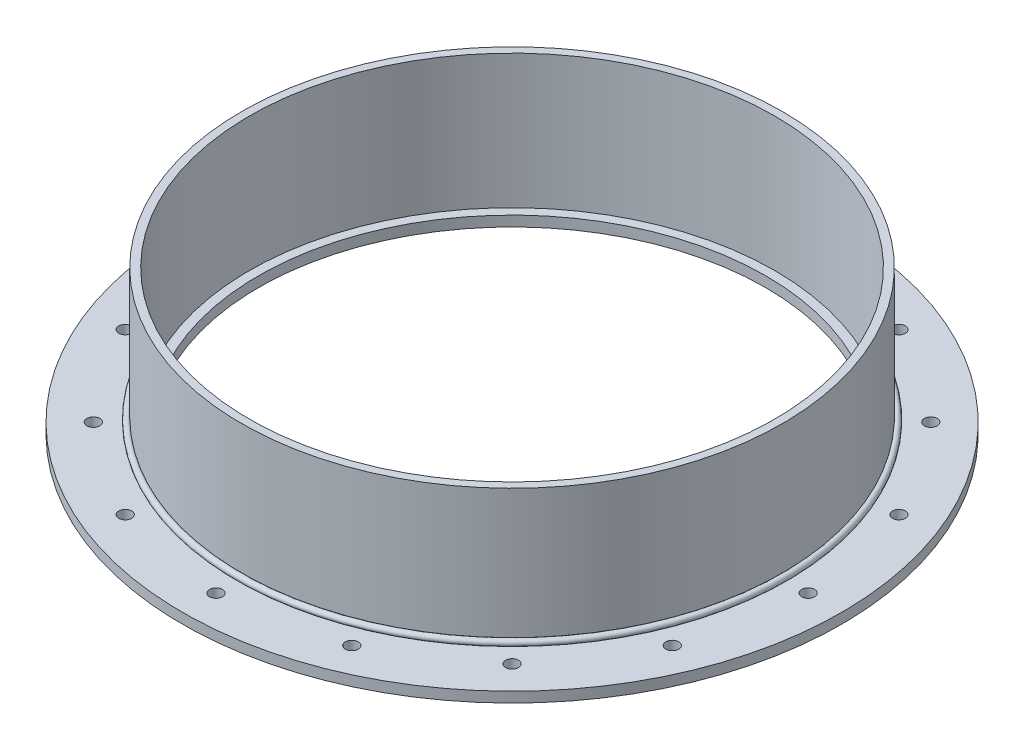
ISO-10303-21;
HEADER;
FILE_DESCRIPTION(('STEP AP214'),'2;1');
FILE_NAME('part.step','',(''),(''),'','','');
FILE_SCHEMA(('AUTOMOTIVE_DESIGN { 1 0 10303 214 1 1 1 1 }'));
ENDSEC;
DATA;
#1=APPLICATION_CONTEXT('core data for automotive mechanical design processes');
#2=APPLICATION_PROTOCOL_DEFINITION('international standard','automotive_design',2000,#1);
#3=PRODUCT_CONTEXT('',#1,'mechanical');
#4=PRODUCT('Part','Part','',(#3));
#5=PRODUCT_RELATED_PRODUCT_CATEGORY('part','',(#4));
#6=PRODUCT_DEFINITION_FORMATION('','',#4);
#7=PRODUCT_DEFINITION_CONTEXT('part definition',#1,'design');
#8=PRODUCT_DEFINITION('design','',#6,#7);
#9=PRODUCT_DEFINITION_SHAPE('','',#8);
#10=(LENGTH_UNIT() NAMED_UNIT(*) SI_UNIT(.MILLI.,.METRE.));
#11=(NAMED_UNIT(*) PLANE_ANGLE_UNIT() SI_UNIT($,.RADIAN.));
#12=(NAMED_UNIT(*) SI_UNIT($,.STERADIAN.) SOLID_ANGLE_UNIT());
#13=UNCERTAINTY_MEASURE_WITH_UNIT(LENGTH_MEASURE(1.E-05),#10,'distance_accuracy_value','');
#14=(GEOMETRIC_REPRESENTATION_CONTEXT(3) GLOBAL_UNCERTAINTY_ASSIGNED_CONTEXT((#13)) GLOBAL_UNIT_ASSIGNED_CONTEXT((#10,
#11,#12)) REPRESENTATION_CONTEXT('',''));
#15=CARTESIAN_POINT('',(0.,0.,0.));
#16=DIRECTION('',(0.,0.,1.));
#17=DIRECTION('',(1.,0.,0.));
#18=AXIS2_PLACEMENT_3D('',#15,#16,#17);
#19=CARTESIAN_POINT('',(0.,7.573372889639,0.));
#20=DIRECTION('',(0.,-1.,0.));
#21=DIRECTION('',(0.,0.,-1.));
#22=AXIS2_PLACEMENT_3D('',#19,#20,#21);
#23=TOROIDAL_SURFACE('',#22,167.910872889639,1.98437500000001);
#24=CARTESIAN_POINT('',(0.,6.35,0.));
#25=DIRECTION('',(0.,-1.,0.));
#26=DIRECTION('',(0.,0.,-1.));
#27=AXIS2_PLACEMENT_3D('',#24,#25,#26);
#28=CIRCLE('',#27,169.473275818951);
#29=CARTESIAN_POINT('',(0.,6.35,-169.473275818951));
#30=VERTEX_POINT('',#29);
#31=EDGE_CURVE('E11',#30,#30,#28,.T.);
#32=ORIENTED_EDGE('',*,*,#31,.F.);
#33=EDGE_LOOP('',(#32));
#34=FACE_BOUND('',#33,.T.);
#35=CARTESIAN_POINT('',(0.,9.13577581895058,0.));
#36=DIRECTION('',(0.,-1.,0.));
#37=DIRECTION('',(0.,0.,-1.));
#38=AXIS2_PLACEMENT_3D('',#35,#36,#37);
#39=CIRCLE('',#38,166.6875);
#40=CARTESIAN_POINT('',(0.,9.13577581895058,-166.6875));
#41=VERTEX_POINT('',#40);
#42=EDGE_CURVE('E61',#41,#41,#39,.T.);
#43=ORIENTED_EDGE('',*,*,#42,.T.);
#44=EDGE_LOOP('',(#43));
#45=FACE_BOUND('',#44,.T.);
#46=ADVANCED_FACE('F48',(#34,#45),#23,.T.);
#47=CARTESIAN_POINT('',(-166.6875,6.35,0.));
#48=DIRECTION('',(0.,1.,0.));
#49=DIRECTION('',(0.,0.,1.));
#50=AXIS2_PLACEMENT_3D('',#47,#48,#49);
#51=PLANE('',#50);
#52=CARTESIAN_POINT('',(0.,6.35,0.));
#53=DIRECTION('',(0.,-1.,0.));
#54=DIRECTION('',(0.,0.,-1.));
#55=AXIS2_PLACEMENT_3D('',#52,#53,#54);
#56=CIRCLE('',#55,166.6875);
#57=CARTESIAN_POINT('',(0.,6.35,-166.6875));
#58=VERTEX_POINT('',#57);
#59=EDGE_CURVE('E55',#58,#58,#56,.T.);
#60=ORIENTED_EDGE('',*,*,#59,.F.);
#61=EDGE_LOOP('',(#60));
#62=FACE_BOUND('',#61,.T.);
#63=ORIENTED_EDGE('',*,*,#31,.T.);
#64=EDGE_LOOP('',(#63));
#65=FACE_BOUND('',#64,.T.);
#66=ADVANCED_FACE('F74',(#62,#65),#51,.F.);
#67=CARTESIAN_POINT('',(0.,0.,0.));
#68=DIRECTION('',(0.,-1.,0.));
#69=DIRECTION('',(0.,0.,-1.));
#70=AXIS2_PLACEMENT_3D('',#67,#68,#69);
#71=CYLINDRICAL_SURFACE('',#70,166.6875);
#72=ORIENTED_EDGE('',*,*,#42,.F.);
#73=EDGE_LOOP('',(#72));
#74=FACE_BOUND('',#73,.T.);
#75=ORIENTED_EDGE('',*,*,#59,.T.);
#76=EDGE_LOOP('',(#75));
#77=FACE_BOUND('',#76,.T.);
#78=ADVANCED_FACE('F72',(#74,#77),#71,.F.);
#79=CLOSED_SHELL('',(#46,#66,#78));
#80=MANIFOLD_SOLID_BREP('B2',#79);
#81=CARTESIAN_POINT('',(0.,0.,0.));
#82=DIRECTION('',(0.,-1.,0.));
#83=DIRECTION('',(0.,0.,-1.));
#84=AXIS2_PLACEMENT_3D('',#81,#82,#83);
#85=CYLINDRICAL_SURFACE('',#84,166.6875);
#86=CARTESIAN_POINT('',(0.,6.35,0.));
#87=DIRECTION('',(0.,-1.,0.));
#88=DIRECTION('',(0.,0.,-1.));
#89=AXIS2_PLACEMENT_3D('',#86,#87,#88);
#90=CIRCLE('',#89,166.6875);
#91=CARTESIAN_POINT('',(0.,6.35,-166.6875));
#92=VERTEX_POINT('',#91);
#93=EDGE_CURVE('E133',#92,#92,#90,.T.);
#94=ORIENTED_EDGE('',*,*,#93,.F.);
#95=EDGE_LOOP('',(#94));
#96=FACE_BOUND('',#95,.T.);
#97=CARTESIAN_POINT('',(0.,88.9,0.));
#98=DIRECTION('',(0.,-1.,0.));
#99=DIRECTION('',(0.,0.,-1.));
#100=AXIS2_PLACEMENT_3D('',#97,#98,#99);
#101=CIRCLE('',#100,166.6875);
#102=CARTESIAN_POINT('',(0.,88.9,-166.6875));
#103=VERTEX_POINT('',#102);
#104=EDGE_CURVE('E47',#103,#103,#101,.T.);
#105=ORIENTED_EDGE('',*,*,#104,.T.);
#106=EDGE_LOOP('',(#105));
#107=FACE_BOUND('',#106,.T.);
#108=ADVANCED_FACE('F114',(#96,#107),#85,.T.);
#109=CARTESIAN_POINT('',(-166.6875,88.9,0.));
#110=DIRECTION('',(0.,-1.,0.));
#111=DIRECTION('',(0.,0.,-1.));
#112=AXIS2_PLACEMENT_3D('',#109,#110,#111);
#113=PLANE('',#112);
#114=ORIENTED_EDGE('',*,*,#104,.F.);
#115=EDGE_LOOP('',(#114));
#116=FACE_BOUND('',#115,.T.);
#117=CARTESIAN_POINT('',(0.,88.9,0.));
#118=DIRECTION('',(0.,-1.,0.));
#119=DIRECTION('',(0.,0.,-1.));
#120=AXIS2_PLACEMENT_3D('',#117,#118,#119);
#121=CIRCLE('',#120,161.925);
#122=CARTESIAN_POINT('',(0.,88.9,-161.925));
#123=VERTEX_POINT('',#122);
#124=EDGE_CURVE('E121',#123,#123,#121,.T.);
#125=ORIENTED_EDGE('',*,*,#124,.T.);
#126=EDGE_LOOP('',(#125));
#127=FACE_BOUND('',#126,.T.);
#128=ADVANCED_FACE('F144',(#116,#127),#113,.F.);
#129=CARTESIAN_POINT('',(0.,0.,0.));
#130=DIRECTION('',(0.,-1.,0.));
#131=DIRECTION('',(0.,0.,-1.));
#132=AXIS2_PLACEMENT_3D('',#129,#130,#131);
#133=CYLINDRICAL_SURFACE('',#132,161.925);
#134=ORIENTED_EDGE('',*,*,#124,.F.);
#135=EDGE_LOOP('',(#134));
#136=FACE_BOUND('',#135,.T.);
#137=CARTESIAN_POINT('',(0.,6.35,0.));
#138=DIRECTION('',(0.,-1.,0.));
#139=DIRECTION('',(0.,0.,-1.));
#140=AXIS2_PLACEMENT_3D('',#137,#138,#139);
#141=CIRCLE('',#140,161.925);
#142=CARTESIAN_POINT('',(0.,6.35,-161.925));
#143=VERTEX_POINT('',#142);
#144=EDGE_CURVE('E127',#143,#143,#141,.T.);
#145=ORIENTED_EDGE('',*,*,#144,.T.);
#146=EDGE_LOOP('',(#145));
#147=FACE_BOUND('',#146,.T.);
#148=ADVANCED_FACE('F148',(#136,#147),#133,.F.);
#149=CARTESIAN_POINT('',(-166.6875,6.35,0.));
#150=DIRECTION('',(0.,1.,0.));
#151=DIRECTION('',(0.,0.,1.));
#152=AXIS2_PLACEMENT_3D('',#149,#150,#151);
#153=PLANE('',#152);
#154=ORIENTED_EDGE('',*,*,#144,.F.);
#155=EDGE_LOOP('',(#154));
#156=FACE_BOUND('',#155,.T.);
#157=ORIENTED_EDGE('',*,*,#93,.T.);
#158=EDGE_LOOP('',(#157));
#159=FACE_BOUND('',#158,.T.);
#160=ADVANCED_FACE('F141',(#156,#159),#153,.F.);
#161=CLOSED_SHELL('',(#108,#128,#148,#160));
#162=MANIFOLD_SOLID_BREP('B6',#161);
#163=CARTESIAN_POINT('',(0.,0.,0.));
#164=DIRECTION('',(0.,-1.,0.));
#165=DIRECTION('',(0.,0.,-1.));
#166=AXIS2_PLACEMENT_3D('',#163,#164,#165);
#167=CYLINDRICAL_SURFACE('',#166,156.36875);
#168=CARTESIAN_POINT('',(0.,6.34999999999999,0.));
#169=DIRECTION('',(0.,-1.,0.));
#170=DIRECTION('',(0.,0.,-1.));
#171=AXIS2_PLACEMENT_3D('',#168,#169,#170);
#172=CIRCLE('',#171,156.36875);
#173=CARTESIAN_POINT('',(0.,6.34999999999999,-156.36875));
#174=VERTEX_POINT('',#173);
#175=EDGE_CURVE('E113',#174,#174,#172,.T.);
#176=ORIENTED_EDGE('',*,*,#175,.F.);
#177=EDGE_LOOP('',(#176));
#178=FACE_BOUND('',#177,.T.);
#179=CARTESIAN_POINT('',(0.,0.,0.));
#180=DIRECTION('',(0.,-1.,0.));
#181=DIRECTION('',(0.,0.,-1.));
#182=AXIS2_PLACEMENT_3D('',#179,#180,#181);
#183=CIRCLE('',#182,156.36875);
#184=CARTESIAN_POINT('',(0.,0.,-156.36875));
#185=VERTEX_POINT('',#184);
#186=EDGE_CURVE('E211',#185,#185,#183,.T.);
#187=ORIENTED_EDGE('',*,*,#186,.T.);
#188=EDGE_LOOP('',(#187));
#189=FACE_BOUND('',#188,.T.);
#190=ADVANCED_FACE('F192',(#178,#189),#167,.F.);
#191=CARTESIAN_POINT('',(-156.36875,6.34999999999999,0.));
#192=DIRECTION('',(0.,-1.,0.));
#193=DIRECTION('',(0.,0.,-1.));
#194=AXIS2_PLACEMENT_3D('',#191,#192,#193);
#195=PLANE('',#194);
#196=CARTESIAN_POINT('',(-69.8636441211494,6.34999999999999,-168.665757154093));
#197=DIRECTION('',(0.,1.,0.));
#198=DIRECTION('',(0.382683432365077,0.,0.923879532511292));
#199=AXIS2_PLACEMENT_3D('',#196,#197,#198);
#200=CIRCLE('',#199,3.96875);
#201=CARTESIAN_POINT('',(-68.3448692489505,6.34999999999999,-164.999110259439));
#202=VERTEX_POINT('',#201);
#203=EDGE_CURVE('E338',#202,#202,#200,.T.);
#204=ORIENTED_EDGE('',*,*,#203,.F.);
#205=EDGE_LOOP('',(#204));
#206=FACE_BOUND('',#205,.T.);
#207=CARTESIAN_POINT('',(-129.091181740367,6.34999999999999,-129.091181740371));
#208=DIRECTION('',(0.,1.,0.));
#209=DIRECTION('',(0.707106781186539,0.,0.707106781186556));
#210=AXIS2_PLACEMENT_3D('',#207,#208,#209);
#211=CIRCLE('',#210,3.96875);
#212=CARTESIAN_POINT('',(-126.284851702533,6.34999999999999,-126.284851702536));
#213=VERTEX_POINT('',#212);
#214=EDGE_CURVE('E330',#213,#213,#211,.T.);
#215=ORIENTED_EDGE('',*,*,#214,.F.);
#216=EDGE_LOOP('',(#215));
#217=FACE_BOUND('',#216,.T.);
#218=CARTESIAN_POINT('',(-168.665757154091,6.34999999999999,-69.8636441211535));
#219=DIRECTION('',(0.,1.,0.));
#220=DIRECTION('',(0.923879532511283,0.,0.3826834323651));
#221=AXIS2_PLACEMENT_3D('',#218,#219,#220);
#222=CIRCLE('',#221,3.96875);
#223=CARTESIAN_POINT('',(-164.999110259437,6.34999999999999,-68.3448692489545));
#224=VERTEX_POINT('',#223);
#225=EDGE_CURVE('E322',#224,#224,#222,.T.);
#226=ORIENTED_EDGE('',*,*,#225,.F.);
#227=EDGE_LOOP('',(#226));
#228=FACE_BOUND('',#227,.T.);
#229=CARTESIAN_POINT('',(-182.5625,6.34999999999999,-1.91224068576765E-12));
#230=DIRECTION('',(0.,1.,0.));
#231=DIRECTION('',(1.,0.,0.));
#232=AXIS2_PLACEMENT_3D('',#229,#230,#231);
#233=CIRCLE('',#232,3.96875);
#234=CARTESIAN_POINT('',(-178.59375,6.34999999999999,-1.87067023607705E-12));
#235=VERTEX_POINT('',#234);
#236=EDGE_CURVE('E314',#235,#235,#233,.T.);
#237=ORIENTED_EDGE('',*,*,#236,.F.);
#238=EDGE_LOOP('',(#237));
#239=FACE_BOUND('',#238,.T.);
#240=CARTESIAN_POINT('',(-168.665757154092,6.34999999999999,69.86364412115));
#241=DIRECTION('',(0.,1.,0.));
#242=DIRECTION('',(0.923879532511291,0.,-0.382683432365081));
#243=AXIS2_PLACEMENT_3D('',#240,#241,#242);
#244=CIRCLE('',#243,3.96875);
#245=CARTESIAN_POINT('',(-164.999110259438,6.34999999999999,68.3448692489511));
#246=VERTEX_POINT('',#245);
#247=EDGE_CURVE('E306',#246,#246,#244,.T.);
#248=ORIENTED_EDGE('',*,*,#247,.F.);
#249=EDGE_LOOP('',(#248));
#250=FACE_BOUND('',#249,.T.);
#251=CARTESIAN_POINT('',(-129.09118174037,6.34999999999999,129.091181740368));
#252=DIRECTION('',(0.,1.,0.));
#253=DIRECTION('',(0.707106781186554,0.,-0.707106781186541));
#254=AXIS2_PLACEMENT_3D('',#251,#252,#253);
#255=CIRCLE('',#254,3.96875);
#256=CARTESIAN_POINT('',(-126.284851702536,6.34999999999999,126.284851702534));
#257=VERTEX_POINT('',#256);
#258=EDGE_CURVE('E298',#257,#257,#255,.T.);
#259=ORIENTED_EDGE('',*,*,#258,.F.);
#260=EDGE_LOOP('',(#259));
#261=FACE_BOUND('',#260,.T.);
#262=CARTESIAN_POINT('',(-69.863644121153,6.34999999999999,168.665757154091));
#263=DIRECTION('',(0.,1.,0.));
#264=DIRECTION('',(0.382683432365097,0.,-0.923879532511284));
#265=AXIS2_PLACEMENT_3D('',#262,#263,#264);
#266=CIRCLE('',#265,3.96875);
#267=CARTESIAN_POINT('',(-68.344869248954,6.34999999999999,164.999110259437));
#268=VERTEX_POINT('',#267);
#269=EDGE_CURVE('E290',#268,#268,#266,.T.);
#270=ORIENTED_EDGE('',*,*,#269,.F.);
#271=EDGE_LOOP('',(#270));
#272=FACE_BOUND('',#271,.T.);
#273=CARTESIAN_POINT('',(0.,6.34999999999999,182.5625));
#274=DIRECTION('',(0.,1.,0.));
#275=DIRECTION('',(0.,0.,-1.));
#276=AXIS2_PLACEMENT_3D('',#273,#274,#275);
#277=CIRCLE('',#276,3.96875);
#278=CARTESIAN_POINT('',(0.,6.34999999999999,178.59375));
#279=VERTEX_POINT('',#278);
#280=EDGE_CURVE('E282',#279,#279,#277,.T.);
#281=ORIENTED_EDGE('',*,*,#280,.F.);
#282=EDGE_LOOP('',(#281));
#283=FACE_BOUND('',#282,.T.);
#284=CARTESIAN_POINT('',(69.8636441211507,6.34999999999999,168.665757154092));
#285=DIRECTION('',(0.,1.,0.));
#286=DIRECTION('',(-0.382683432365084,0.,-0.923879532511289));
#287=AXIS2_PLACEMENT_3D('',#284,#285,#286);
#288=CIRCLE('',#287,3.96875);
#289=CARTESIAN_POINT('',(68.3448692489517,6.34999999999999,164.999110259438));
#290=VERTEX_POINT('',#289);
#291=EDGE_CURVE('E274',#290,#290,#288,.T.);
#292=ORIENTED_EDGE('',*,*,#291,.F.);
#293=EDGE_LOOP('',(#292));
#294=FACE_BOUND('',#293,.T.);
#295=CARTESIAN_POINT('',(129.091181740368,6.34999999999999,129.09118174037));
#296=DIRECTION('',(0.,1.,0.));
#297=DIRECTION('',(-0.707106781186544,0.,-0.707106781186551));
#298=AXIS2_PLACEMENT_3D('',#295,#296,#297);
#299=CIRCLE('',#298,3.96875);
#300=CARTESIAN_POINT('',(126.284851702534,6.34999999999999,126.284851702536));
#301=VERTEX_POINT('',#300);
#302=EDGE_CURVE('E266',#301,#301,#299,.T.);
#303=ORIENTED_EDGE('',*,*,#302,.F.);
#304=EDGE_LOOP('',(#303));
#305=FACE_BOUND('',#304,.T.);
#306=CARTESIAN_POINT('',(168.665757154092,6.34999999999999,69.8636441211524));
#307=DIRECTION('',(0.,1.,0.));
#308=DIRECTION('',(-0.923879532511285,0.,-0.382683432365094));
#309=AXIS2_PLACEMENT_3D('',#306,#307,#308);
#310=CIRCLE('',#309,3.96875);
#311=CARTESIAN_POINT('',(164.999110259437,6.34999999999999,68.3448692489535));
#312=VERTEX_POINT('',#311);
#313=EDGE_CURVE('E258',#312,#312,#310,.T.);
#314=ORIENTED_EDGE('',*,*,#313,.F.);
#315=EDGE_LOOP('',(#314));
#316=FACE_BOUND('',#315,.T.);
#317=CARTESIAN_POINT('',(182.5625,6.34999999999999,6.37413561922549E-13));
#318=DIRECTION('',(0.,1.,0.));
#319=DIRECTION('',(-1.,0.,0.));
#320=AXIS2_PLACEMENT_3D('',#317,#318,#319);
#321=CIRCLE('',#320,3.96875);
#322=CARTESIAN_POINT('',(178.59375,6.34999999999999,6.23556745359016E-13));
#323=VERTEX_POINT('',#322);
#324=EDGE_CURVE('E250',#323,#323,#321,.T.);
#325=ORIENTED_EDGE('',*,*,#324,.F.);
#326=EDGE_LOOP('',(#325));
#327=FACE_BOUND('',#326,.T.);
#328=CARTESIAN_POINT('',(168.665757154092,6.34999999999999,-69.8636441211513));
#329=DIRECTION('',(0.,1.,0.));
#330=DIRECTION('',(-0.923879532511288,0.,0.382683432365087));
#331=AXIS2_PLACEMENT_3D('',#328,#329,#330);
#332=CIRCLE('',#331,3.96875);
#333=CARTESIAN_POINT('',(164.999110259438,6.34999999999999,-68.3448692489523));
#334=VERTEX_POINT('',#333);
#335=EDGE_CURVE('E242',#334,#334,#332,.T.);
#336=ORIENTED_EDGE('',*,*,#335,.F.);
#337=EDGE_LOOP('',(#336));
#338=FACE_BOUND('',#337,.T.);
#339=CARTESIAN_POINT('',(129.091181740369,6.34999999999999,-129.091181740369));
#340=DIRECTION('',(0.,1.,0.));
#341=DIRECTION('',(-0.707106781186549,0.,0.707106781186546));
#342=AXIS2_PLACEMENT_3D('',#339,#340,#341);
#343=CIRCLE('',#342,3.96875);
#344=CARTESIAN_POINT('',(126.284851702535,6.34999999999999,-126.284851702535));
#345=VERTEX_POINT('',#344);
#346=EDGE_CURVE('E234',#345,#345,#343,.T.);
#347=ORIENTED_EDGE('',*,*,#346,.F.);
#348=EDGE_LOOP('',(#347));
#349=FACE_BOUND('',#348,.T.);
#350=CARTESIAN_POINT('',(69.8636441211519,6.34999999999999,-168.665757154092));
#351=DIRECTION('',(0.,1.,0.));
#352=DIRECTION('',(-0.382683432365091,0.,0.923879532511287));
#353=AXIS2_PLACEMENT_3D('',#350,#351,#352);
#354=CIRCLE('',#353,3.96875);
#355=CARTESIAN_POINT('',(68.3448692489529,6.34999999999999,-164.999110259438));
#356=VERTEX_POINT('',#355);
#357=EDGE_CURVE('E226',#356,#356,#354,.T.);
#358=ORIENTED_EDGE('',*,*,#357,.F.);
#359=EDGE_LOOP('',(#358));
#360=FACE_BOUND('',#359,.T.);
#361=CARTESIAN_POINT('',(0.,6.34999999999999,-182.5625));
#362=DIRECTION('',(0.,1.,0.));
#363=DIRECTION('',(0.,0.,1.));
#364=AXIS2_PLACEMENT_3D('',#361,#362,#363);
#365=CIRCLE('',#364,3.96875);
#366=CARTESIAN_POINT('',(0.,6.34999999999999,-178.59375));
#367=VERTEX_POINT('',#366);
#368=EDGE_CURVE('E218',#367,#367,#365,.T.);
#369=ORIENTED_EDGE('',*,*,#368,.F.);
#370=EDGE_LOOP('',(#369));
#371=FACE_BOUND('',#370,.T.);
#372=CARTESIAN_POINT('',(0.,6.35,0.));
#373=DIRECTION('',(0.,-1.,0.));
#374=DIRECTION('',(0.,0.,-1.));
#375=AXIS2_PLACEMENT_3D('',#372,#373,#374);
#376=CIRCLE('',#375,203.2);
#377=CARTESIAN_POINT('',(0.,6.35,-203.2));
#378=VERTEX_POINT('',#377);
#379=EDGE_CURVE('E199',#378,#378,#376,.T.);
#380=ORIENTED_EDGE('',*,*,#379,.F.);
#381=EDGE_LOOP('',(#380));
#382=FACE_BOUND('',#381,.T.);
#383=ORIENTED_EDGE('',*,*,#175,.T.);
#384=EDGE_LOOP('',(#383));
#385=FACE_BOUND('',#384,.T.);
#386=ADVANCED_FACE('F357',(#206,#217,#228,#239,#250,#261,#272,#283,#294,#305,#316,#327,#338,
#349,#360,#371,#382,#385),#195,.F.);
#387=CARTESIAN_POINT('',(0.,0.,0.));
#388=DIRECTION('',(0.,-1.,0.));
#389=DIRECTION('',(0.,0.,-1.));
#390=AXIS2_PLACEMENT_3D('',#387,#388,#389);
#391=CYLINDRICAL_SURFACE('',#390,203.2);
#392=CARTESIAN_POINT('',(0.,0.,0.));
#393=DIRECTION('',(0.,-1.,0.));
#394=DIRECTION('',(0.,0.,-1.));
#395=AXIS2_PLACEMENT_3D('',#392,#393,#394);
#396=CIRCLE('',#395,203.2);
#397=CARTESIAN_POINT('',(0.,0.,-203.2));
#398=VERTEX_POINT('',#397);
#399=EDGE_CURVE('E205',#398,#398,#396,.T.);
#400=ORIENTED_EDGE('',*,*,#399,.F.);
#401=EDGE_LOOP('',(#400));
#402=FACE_BOUND('',#401,.T.);
#403=ORIENTED_EDGE('',*,*,#379,.T.);
#404=EDGE_LOOP('',(#403));
#405=FACE_BOUND('',#404,.T.);
#406=ADVANCED_FACE('F360',(#402,#405),#391,.T.);
#407=CARTESIAN_POINT('',(-156.36875,0.,0.));
#408=DIRECTION('',(0.,1.,0.));
#409=DIRECTION('',(0.,0.,1.));
#410=AXIS2_PLACEMENT_3D('',#407,#408,#409);
#411=PLANE('',#410);
#412=CARTESIAN_POINT('',(-69.8636441211494,0.,-168.665757154093));
#413=DIRECTION('',(0.,1.,0.));
#414=DIRECTION('',(0.382683432365077,0.,0.923879532511292));
#415=AXIS2_PLACEMENT_3D('',#412,#413,#414);
#416=CIRCLE('',#415,3.96875);
#417=CARTESIAN_POINT('',(-68.3448692489505,0.,-164.999110259439));
#418=VERTEX_POINT('',#417);
#419=EDGE_CURVE('E334',#418,#418,#416,.T.);
#420=ORIENTED_EDGE('',*,*,#419,.T.);
#421=EDGE_LOOP('',(#420));
#422=FACE_BOUND('',#421,.T.);
#423=CARTESIAN_POINT('',(-129.091181740367,0.,-129.091181740371));
#424=DIRECTION('',(0.,1.,0.));
#425=DIRECTION('',(0.707106781186539,0.,0.707106781186556));
#426=AXIS2_PLACEMENT_3D('',#423,#424,#425);
#427=CIRCLE('',#426,3.96875);
#428=CARTESIAN_POINT('',(-126.284851702533,0.,-126.284851702536));
#429=VERTEX_POINT('',#428);
#430=EDGE_CURVE('E326',#429,#429,#427,.T.);
#431=ORIENTED_EDGE('',*,*,#430,.T.);
#432=EDGE_LOOP('',(#431));
#433=FACE_BOUND('',#432,.T.);
#434=CARTESIAN_POINT('',(-168.665757154091,0.,-69.8636441211535));
#435=DIRECTION('',(0.,1.,0.));
#436=DIRECTION('',(0.923879532511283,0.,0.3826834323651));
#437=AXIS2_PLACEMENT_3D('',#434,#435,#436);
#438=CIRCLE('',#437,3.96875);
#439=CARTESIAN_POINT('',(-164.999110259437,0.,-68.3448692489545));
#440=VERTEX_POINT('',#439);
#441=EDGE_CURVE('E318',#440,#440,#438,.T.);
#442=ORIENTED_EDGE('',*,*,#441,.T.);
#443=EDGE_LOOP('',(#442));
#444=FACE_BOUND('',#443,.T.);
#445=CARTESIAN_POINT('',(-182.5625,0.,-1.91224068576765E-12));
#446=DIRECTION('',(0.,1.,0.));
#447=DIRECTION('',(1.,0.,0.));
#448=AXIS2_PLACEMENT_3D('',#445,#446,#447);
#449=CIRCLE('',#448,3.96875);
#450=CARTESIAN_POINT('',(-178.59375,0.,-1.87067023607705E-12));
#451=VERTEX_POINT('',#450);
#452=EDGE_CURVE('E310',#451,#451,#449,.T.);
#453=ORIENTED_EDGE('',*,*,#452,.T.);
#454=EDGE_LOOP('',(#453));
#455=FACE_BOUND('',#454,.T.);
#456=CARTESIAN_POINT('',(-168.665757154092,0.,69.86364412115));
#457=DIRECTION('',(0.,1.,0.));
#458=DIRECTION('',(0.923879532511291,0.,-0.382683432365081));
#459=AXIS2_PLACEMENT_3D('',#456,#457,#458);
#460=CIRCLE('',#459,3.96875);
#461=CARTESIAN_POINT('',(-164.999110259438,0.,68.3448692489511));
#462=VERTEX_POINT('',#461);
#463=EDGE_CURVE('E302',#462,#462,#460,.T.);
#464=ORIENTED_EDGE('',*,*,#463,.T.);
#465=EDGE_LOOP('',(#464));
#466=FACE_BOUND('',#465,.T.);
#467=CARTESIAN_POINT('',(-129.09118174037,0.,129.091181740368));
#468=DIRECTION('',(0.,1.,0.));
#469=DIRECTION('',(0.707106781186554,0.,-0.707106781186541));
#470=AXIS2_PLACEMENT_3D('',#467,#468,#469);
#471=CIRCLE('',#470,3.96875);
#472=CARTESIAN_POINT('',(-126.284851702536,0.,126.284851702534));
#473=VERTEX_POINT('',#472);
#474=EDGE_CURVE('E294',#473,#473,#471,.T.);
#475=ORIENTED_EDGE('',*,*,#474,.T.);
#476=EDGE_LOOP('',(#475));
#477=FACE_BOUND('',#476,.T.);
#478=CARTESIAN_POINT('',(-69.863644121153,0.,168.665757154091));
#479=DIRECTION('',(0.,1.,0.));
#480=DIRECTION('',(0.382683432365097,0.,-0.923879532511284));
#481=AXIS2_PLACEMENT_3D('',#478,#479,#480);
#482=CIRCLE('',#481,3.96875);
#483=CARTESIAN_POINT('',(-68.344869248954,0.,164.999110259437));
#484=VERTEX_POINT('',#483);
#485=EDGE_CURVE('E286',#484,#484,#482,.T.);
#486=ORIENTED_EDGE('',*,*,#485,.T.);
#487=EDGE_LOOP('',(#486));
#488=FACE_BOUND('',#487,.T.);
#489=CARTESIAN_POINT('',(0.,0.,182.5625));
#490=DIRECTION('',(0.,1.,0.));
#491=DIRECTION('',(0.,0.,-1.));
#492=AXIS2_PLACEMENT_3D('',#489,#490,#491);
#493=CIRCLE('',#492,3.96875);
#494=CARTESIAN_POINT('',(0.,0.,178.59375));
#495=VERTEX_POINT('',#494);
#496=EDGE_CURVE('E278',#495,#495,#493,.T.);
#497=ORIENTED_EDGE('',*,*,#496,.T.);
#498=EDGE_LOOP('',(#497));
#499=FACE_BOUND('',#498,.T.);
#500=CARTESIAN_POINT('',(69.8636441211507,0.,168.665757154092));
#501=DIRECTION('',(0.,1.,0.));
#502=DIRECTION('',(-0.382683432365084,0.,-0.923879532511289));
#503=AXIS2_PLACEMENT_3D('',#500,#501,#502);
#504=CIRCLE('',#503,3.96875);
#505=CARTESIAN_POINT('',(68.3448692489517,0.,164.999110259438));
#506=VERTEX_POINT('',#505);
#507=EDGE_CURVE('E270',#506,#506,#504,.T.);
#508=ORIENTED_EDGE('',*,*,#507,.T.);
#509=EDGE_LOOP('',(#508));
#510=FACE_BOUND('',#509,.T.);
#511=CARTESIAN_POINT('',(129.091181740368,0.,129.09118174037));
#512=DIRECTION('',(0.,1.,0.));
#513=DIRECTION('',(-0.707106781186544,0.,-0.707106781186551));
#514=AXIS2_PLACEMENT_3D('',#511,#512,#513);
#515=CIRCLE('',#514,3.96875);
#516=CARTESIAN_POINT('',(126.284851702534,0.,126.284851702536));
#517=VERTEX_POINT('',#516);
#518=EDGE_CURVE('E262',#517,#517,#515,.T.);
#519=ORIENTED_EDGE('',*,*,#518,.T.);
#520=EDGE_LOOP('',(#519));
#521=FACE_BOUND('',#520,.T.);
#522=CARTESIAN_POINT('',(168.665757154092,0.,69.8636441211524));
#523=DIRECTION('',(0.,1.,0.));
#524=DIRECTION('',(-0.923879532511285,0.,-0.382683432365094));
#525=AXIS2_PLACEMENT_3D('',#522,#523,#524);
#526=CIRCLE('',#525,3.96875);
#527=CARTESIAN_POINT('',(164.999110259437,0.,68.3448692489535));
#528=VERTEX_POINT('',#527);
#529=EDGE_CURVE('E254',#528,#528,#526,.T.);
#530=ORIENTED_EDGE('',*,*,#529,.T.);
#531=EDGE_LOOP('',(#530));
#532=FACE_BOUND('',#531,.T.);
#533=CARTESIAN_POINT('',(182.5625,0.,6.37413561922549E-13));
#534=DIRECTION('',(0.,1.,0.));
#535=DIRECTION('',(-1.,0.,0.));
#536=AXIS2_PLACEMENT_3D('',#533,#534,#535);
#537=CIRCLE('',#536,3.96875);
#538=CARTESIAN_POINT('',(178.59375,0.,6.23556745359016E-13));
#539=VERTEX_POINT('',#538);
#540=EDGE_CURVE('E246',#539,#539,#537,.T.);
#541=ORIENTED_EDGE('',*,*,#540,.T.);
#542=EDGE_LOOP('',(#541));
#543=FACE_BOUND('',#542,.T.);
#544=CARTESIAN_POINT('',(168.665757154092,0.,-69.8636441211513));
#545=DIRECTION('',(0.,1.,0.));
#546=DIRECTION('',(-0.923879532511288,0.,0.382683432365087));
#547=AXIS2_PLACEMENT_3D('',#544,#545,#546);
#548=CIRCLE('',#547,3.96875);
#549=CARTESIAN_POINT('',(164.999110259438,0.,-68.3448692489523));
#550=VERTEX_POINT('',#549);
#551=EDGE_CURVE('E238',#550,#550,#548,.T.);
#552=ORIENTED_EDGE('',*,*,#551,.T.);
#553=EDGE_LOOP('',(#552));
#554=FACE_BOUND('',#553,.T.);
#555=CARTESIAN_POINT('',(129.091181740369,0.,-129.091181740369));
#556=DIRECTION('',(0.,1.,0.));
#557=DIRECTION('',(-0.707106781186549,0.,0.707106781186546));
#558=AXIS2_PLACEMENT_3D('',#555,#556,#557);
#559=CIRCLE('',#558,3.96875);
#560=CARTESIAN_POINT('',(126.284851702535,0.,-126.284851702535));
#561=VERTEX_POINT('',#560);
#562=EDGE_CURVE('E230',#561,#561,#559,.T.);
#563=ORIENTED_EDGE('',*,*,#562,.T.);
#564=EDGE_LOOP('',(#563));
#565=FACE_BOUND('',#564,.T.);
#566=CARTESIAN_POINT('',(69.8636441211519,0.,-168.665757154092));
#567=DIRECTION('',(0.,1.,0.));
#568=DIRECTION('',(-0.382683432365091,0.,0.923879532511287));
#569=AXIS2_PLACEMENT_3D('',#566,#567,#568);
#570=CIRCLE('',#569,3.96875);
#571=CARTESIAN_POINT('',(68.3448692489529,0.,-164.999110259438));
#572=VERTEX_POINT('',#571);
#573=EDGE_CURVE('E222',#572,#572,#570,.T.);
#574=ORIENTED_EDGE('',*,*,#573,.T.);
#575=EDGE_LOOP('',(#574));
#576=FACE_BOUND('',#575,.T.);
#577=CARTESIAN_POINT('',(0.,0.,-182.5625));
#578=DIRECTION('',(0.,1.,0.));
#579=DIRECTION('',(0.,0.,1.));
#580=AXIS2_PLACEMENT_3D('',#577,#578,#579);
#581=CIRCLE('',#580,3.96875);
#582=CARTESIAN_POINT('',(0.,0.,-178.59375));
#583=VERTEX_POINT('',#582);
#584=EDGE_CURVE('E217',#583,#583,#581,.T.);
#585=ORIENTED_EDGE('',*,*,#584,.T.);
#586=EDGE_LOOP('',(#585));
#587=FACE_BOUND('',#586,.T.);
#588=ORIENTED_EDGE('',*,*,#186,.F.);
#589=EDGE_LOOP('',(#588));
#590=FACE_BOUND('',#589,.T.);
#591=ORIENTED_EDGE('',*,*,#399,.T.);
#592=EDGE_LOOP('',(#591));
#593=FACE_BOUND('',#592,.T.);
#594=ADVANCED_FACE('F347',(#422,#433,#444,#455,#466,#477,#488,#499,#510,#521,#532,#543,#554,
#565,#576,#587,#590,#593),#411,.F.);
#595=CARTESIAN_POINT('',(0.,0.,-182.5625));
#596=DIRECTION('',(0.,1.,0.));
#597=DIRECTION('',(0.,0.,1.));
#598=AXIS2_PLACEMENT_3D('',#595,#596,#597);
#599=CYLINDRICAL_SURFACE('',#598,3.96875);
#600=ORIENTED_EDGE('',*,*,#584,.F.);
#601=EDGE_LOOP('',(#600));
#602=FACE_BOUND('',#601,.T.);
#603=ORIENTED_EDGE('',*,*,#368,.T.);
#604=EDGE_LOOP('',(#603));
#605=FACE_BOUND('',#604,.T.);
#606=ADVANCED_FACE('F392',(#602,#605),#599,.F.);
#607=CARTESIAN_POINT('',(69.8636441211519,0.,-168.665757154092));
#608=DIRECTION('',(0.,1.,0.));
#609=DIRECTION('',(0.,0.,1.));
#610=AXIS2_PLACEMENT_3D('',#607,#608,#609);
#611=CYLINDRICAL_SURFACE('',#610,3.96875);
#612=ORIENTED_EDGE('',*,*,#573,.F.);
#613=EDGE_LOOP('',(#612));
#614=FACE_BOUND('',#613,.T.);
#615=ORIENTED_EDGE('',*,*,#357,.T.);
#616=EDGE_LOOP('',(#615));
#617=FACE_BOUND('',#616,.T.);
#618=ADVANCED_FACE('F394',(#614,#617),#611,.F.);
#619=CARTESIAN_POINT('',(129.091181740369,0.,-129.091181740369));
#620=DIRECTION('',(0.,1.,0.));
#621=DIRECTION('',(0.,0.,1.));
#622=AXIS2_PLACEMENT_3D('',#619,#620,#621);
#623=CYLINDRICAL_SURFACE('',#622,3.96875);
#624=ORIENTED_EDGE('',*,*,#562,.F.);
#625=EDGE_LOOP('',(#624));
#626=FACE_BOUND('',#625,.T.);
#627=ORIENTED_EDGE('',*,*,#346,.T.);
#628=EDGE_LOOP('',(#627));
#629=FACE_BOUND('',#628,.T.);
#630=ADVANCED_FACE('F401',(#626,#629),#623,.F.);
#631=CARTESIAN_POINT('',(168.665757154092,0.,-69.8636441211513));
#632=DIRECTION('',(0.,1.,0.));
#633=DIRECTION('',(0.,0.,1.));
#634=AXIS2_PLACEMENT_3D('',#631,#632,#633);
#635=CYLINDRICAL_SURFACE('',#634,3.96875);
#636=ORIENTED_EDGE('',*,*,#551,.F.);
#637=EDGE_LOOP('',(#636));
#638=FACE_BOUND('',#637,.T.);
#639=ORIENTED_EDGE('',*,*,#335,.T.);
#640=EDGE_LOOP('',(#639));
#641=FACE_BOUND('',#640,.T.);
#642=ADVANCED_FACE('F446',(#638,#641),#635,.F.);
#643=CARTESIAN_POINT('',(182.5625,0.,6.37413561922549E-13));
#644=DIRECTION('',(0.,1.,0.));
#645=DIRECTION('',(0.,0.,1.));
#646=AXIS2_PLACEMENT_3D('',#643,#644,#645);
#647=CYLINDRICAL_SURFACE('',#646,3.96875);
#648=ORIENTED_EDGE('',*,*,#540,.F.);
#649=EDGE_LOOP('',(#648));
#650=FACE_BOUND('',#649,.T.);
#651=ORIENTED_EDGE('',*,*,#324,.T.);
#652=EDGE_LOOP('',(#651));
#653=FACE_BOUND('',#652,.T.);
#654=ADVANCED_FACE('F456',(#650,#653),#647,.F.);
#655=CARTESIAN_POINT('',(168.665757154092,0.,69.8636441211524));
#656=DIRECTION('',(0.,1.,0.));
#657=DIRECTION('',(0.,0.,1.));
#658=AXIS2_PLACEMENT_3D('',#655,#656,#657);
#659=CYLINDRICAL_SURFACE('',#658,3.96875);
#660=ORIENTED_EDGE('',*,*,#529,.F.);
#661=EDGE_LOOP('',(#660));
#662=FACE_BOUND('',#661,.T.);
#663=ORIENTED_EDGE('',*,*,#313,.T.);
#664=EDGE_LOOP('',(#663));
#665=FACE_BOUND('',#664,.T.);
#666=ADVANCED_FACE('F466',(#662,#665),#659,.F.);
#667=CARTESIAN_POINT('',(129.091181740368,0.,129.09118174037));
#668=DIRECTION('',(0.,1.,0.));
#669=DIRECTION('',(0.,0.,1.));
#670=AXIS2_PLACEMENT_3D('',#667,#668,#669);
#671=CYLINDRICAL_SURFACE('',#670,3.96875);
#672=ORIENTED_EDGE('',*,*,#518,.F.);
#673=EDGE_LOOP('',(#672));
#674=FACE_BOUND('',#673,.T.);
#675=ORIENTED_EDGE('',*,*,#302,.T.);
#676=EDGE_LOOP('',(#675));
#677=FACE_BOUND('',#676,.T.);
#678=ADVANCED_FACE('F476',(#674,#677),#671,.F.);
#679=CARTESIAN_POINT('',(69.8636441211507,0.,168.665757154092));
#680=DIRECTION('',(0.,1.,0.));
#681=DIRECTION('',(0.,0.,1.));
#682=AXIS2_PLACEMENT_3D('',#679,#680,#681);
#683=CYLINDRICAL_SURFACE('',#682,3.96875);
#684=ORIENTED_EDGE('',*,*,#507,.F.);
#685=EDGE_LOOP('',(#684));
#686=FACE_BOUND('',#685,.T.);
#687=ORIENTED_EDGE('',*,*,#291,.T.);
#688=EDGE_LOOP('',(#687));
#689=FACE_BOUND('',#688,.T.);
#690=ADVANCED_FACE('F486',(#686,#689),#683,.F.);
#691=CARTESIAN_POINT('',(0.,0.,182.5625));
#692=DIRECTION('',(0.,1.,0.));
#693=DIRECTION('',(0.,0.,1.));
#694=AXIS2_PLACEMENT_3D('',#691,#692,#693);
#695=CYLINDRICAL_SURFACE('',#694,3.96875);
#696=ORIENTED_EDGE('',*,*,#496,.F.);
#697=EDGE_LOOP('',(#696));
#698=FACE_BOUND('',#697,.T.);
#699=ORIENTED_EDGE('',*,*,#280,.T.);
#700=EDGE_LOOP('',(#699));
#701=FACE_BOUND('',#700,.T.);
#702=ADVANCED_FACE('F496',(#698,#701),#695,.F.);
#703=CARTESIAN_POINT('',(-69.863644121153,0.,168.665757154091));
#704=DIRECTION('',(0.,1.,0.));
#705=DIRECTION('',(0.,0.,1.));
#706=AXIS2_PLACEMENT_3D('',#703,#704,#705);
#707=CYLINDRICAL_SURFACE('',#706,3.96875);
#708=ORIENTED_EDGE('',*,*,#485,.F.);
#709=EDGE_LOOP('',(#708));
#710=FACE_BOUND('',#709,.T.);
#711=ORIENTED_EDGE('',*,*,#269,.T.);
#712=EDGE_LOOP('',(#711));
#713=FACE_BOUND('',#712,.T.);
#714=ADVANCED_FACE('F506',(#710,#713),#707,.F.);
#715=CARTESIAN_POINT('',(-129.09118174037,0.,129.091181740368));
#716=DIRECTION('',(0.,1.,0.));
#717=DIRECTION('',(0.,0.,1.));
#718=AXIS2_PLACEMENT_3D('',#715,#716,#717);
#719=CYLINDRICAL_SURFACE('',#718,3.96875);
#720=ORIENTED_EDGE('',*,*,#474,.F.);
#721=EDGE_LOOP('',(#720));
#722=FACE_BOUND('',#721,.T.);
#723=ORIENTED_EDGE('',*,*,#258,.T.);
#724=EDGE_LOOP('',(#723));
#725=FACE_BOUND('',#724,.T.);
#726=ADVANCED_FACE('F516',(#722,#725),#719,.F.);
#727=CARTESIAN_POINT('',(-168.665757154092,0.,69.86364412115));
#728=DIRECTION('',(0.,1.,0.));
#729=DIRECTION('',(0.,0.,1.));
#730=AXIS2_PLACEMENT_3D('',#727,#728,#729);
#731=CYLINDRICAL_SURFACE('',#730,3.96875);
#732=ORIENTED_EDGE('',*,*,#463,.F.);
#733=EDGE_LOOP('',(#732));
#734=FACE_BOUND('',#733,.T.);
#735=ORIENTED_EDGE('',*,*,#247,.T.);
#736=EDGE_LOOP('',(#735));
#737=FACE_BOUND('',#736,.T.);
#738=ADVANCED_FACE('F526',(#734,#737),#731,.F.);
#739=CARTESIAN_POINT('',(-182.5625,0.,-1.91224068576765E-12));
#740=DIRECTION('',(0.,1.,0.));
#741=DIRECTION('',(0.,0.,1.));
#742=AXIS2_PLACEMENT_3D('',#739,#740,#741);
#743=CYLINDRICAL_SURFACE('',#742,3.96875);
#744=ORIENTED_EDGE('',*,*,#452,.F.);
#745=EDGE_LOOP('',(#744));
#746=FACE_BOUND('',#745,.T.);
#747=ORIENTED_EDGE('',*,*,#236,.T.);
#748=EDGE_LOOP('',(#747));
#749=FACE_BOUND('',#748,.T.);
#750=ADVANCED_FACE('F536',(#746,#749),#743,.F.);
#751=CARTESIAN_POINT('',(-168.665757154091,0.,-69.8636441211535));
#752=DIRECTION('',(0.,1.,0.));
#753=DIRECTION('',(0.,0.,1.));
#754=AXIS2_PLACEMENT_3D('',#751,#752,#753);
#755=CYLINDRICAL_SURFACE('',#754,3.96875);
#756=ORIENTED_EDGE('',*,*,#441,.F.);
#757=EDGE_LOOP('',(#756));
#758=FACE_BOUND('',#757,.T.);
#759=ORIENTED_EDGE('',*,*,#225,.T.);
#760=EDGE_LOOP('',(#759));
#761=FACE_BOUND('',#760,.T.);
#762=ADVANCED_FACE('F546',(#758,#761),#755,.F.);
#763=CARTESIAN_POINT('',(-129.091181740367,0.,-129.091181740371));
#764=DIRECTION('',(0.,1.,0.));
#765=DIRECTION('',(0.,0.,1.));
#766=AXIS2_PLACEMENT_3D('',#763,#764,#765);
#767=CYLINDRICAL_SURFACE('',#766,3.96875);
#768=ORIENTED_EDGE('',*,*,#430,.F.);
#769=EDGE_LOOP('',(#768));
#770=FACE_BOUND('',#769,.T.);
#771=ORIENTED_EDGE('',*,*,#214,.T.);
#772=EDGE_LOOP('',(#771));
#773=FACE_BOUND('',#772,.T.);
#774=ADVANCED_FACE('F353',(#770,#773),#767,.F.);
#775=CARTESIAN_POINT('',(-69.8636441211494,0.,-168.665757154093));
#776=DIRECTION('',(0.,1.,0.));
#777=DIRECTION('',(0.,0.,1.));
#778=AXIS2_PLACEMENT_3D('',#775,#776,#777);
#779=CYLINDRICAL_SURFACE('',#778,3.96875);
#780=ORIENTED_EDGE('',*,*,#419,.F.);
#781=EDGE_LOOP('',(#780));
#782=FACE_BOUND('',#781,.T.);
#783=ORIENTED_EDGE('',*,*,#203,.T.);
#784=EDGE_LOOP('',(#783));
#785=FACE_BOUND('',#784,.T.);
#786=ADVANCED_FACE('F350',(#782,#785),#779,.F.);
#787=CLOSED_SHELL('',(#190,#386,#406,#594,#606,#618,#630,#642,#654,#666,#678,#690,#702,#714,
#726,#738,#750,#762,#774,#786));
#788=MANIFOLD_SOLID_BREP('B42',#787);
#789=ADVANCED_BREP_SHAPE_REPRESENTATION('',(#18,#80,#162,#788),#14);
#790=SHAPE_DEFINITION_REPRESENTATION(#9,#789);
ENDSEC;
END-ISO-10303-21;
